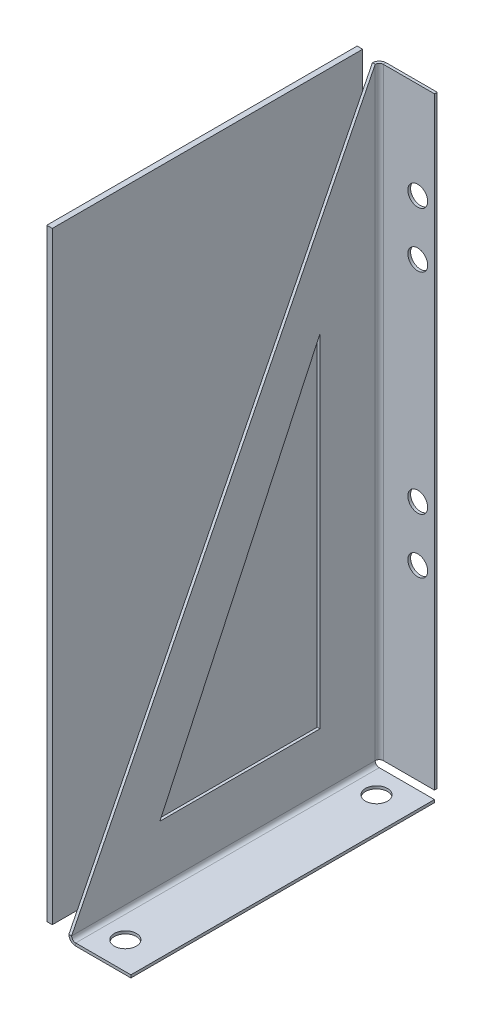
ISO-10303-21;
HEADER;
FILE_DESCRIPTION(('STEP AP214'),'2;1');
FILE_NAME('part.step','',(''),(''),'','','');
FILE_SCHEMA(('AUTOMOTIVE_DESIGN { 1 0 10303 214 1 1 1 1 }'));
ENDSEC;
DATA;
#1=APPLICATION_CONTEXT('core data for automotive mechanical design processes');
#2=APPLICATION_PROTOCOL_DEFINITION('international standard','automotive_design',2000,#1);
#3=PRODUCT_CONTEXT('',#1,'mechanical');
#4=PRODUCT('Part','Part','',(#3));
#5=PRODUCT_RELATED_PRODUCT_CATEGORY('part','',(#4));
#6=PRODUCT_DEFINITION_FORMATION('','',#4);
#7=PRODUCT_DEFINITION_CONTEXT('part definition',#1,'design');
#8=PRODUCT_DEFINITION('design','',#6,#7);
#9=PRODUCT_DEFINITION_SHAPE('','',#8);
#10=(LENGTH_UNIT() NAMED_UNIT(*) SI_UNIT(.MILLI.,.METRE.));
#11=(NAMED_UNIT(*) PLANE_ANGLE_UNIT() SI_UNIT($,.RADIAN.));
#12=(NAMED_UNIT(*) SI_UNIT($,.STERADIAN.) SOLID_ANGLE_UNIT());
#13=UNCERTAINTY_MEASURE_WITH_UNIT(LENGTH_MEASURE(1.E-05),#10,'distance_accuracy_value','');
#14=(GEOMETRIC_REPRESENTATION_CONTEXT(3) GLOBAL_UNCERTAINTY_ASSIGNED_CONTEXT((#13)) GLOBAL_UNIT_ASSIGNED_CONTEXT((#10,
#11,#12)) REPRESENTATION_CONTEXT('',''));
#15=CARTESIAN_POINT('',(0.,0.,0.));
#16=DIRECTION('',(0.,0.,1.));
#17=DIRECTION('',(1.,0.,0.));
#18=AXIS2_PLACEMENT_3D('',#15,#16,#17);
#19=CARTESIAN_POINT('',(-22.0473724951904,110.,-23.1894911407776));
#20=DIRECTION('',(0.,0.,1.));
#21=DIRECTION('',(1.,0.,0.));
#22=AXIS2_PLACEMENT_3D('',#19,#20,#21);
#23=PLANE('',#22);
#24=DIRECTION('',(0.,-1.,0.));
#25=VECTOR('',#24,1.);
#26=CARTESIAN_POINT('',(-21.0473724951904,110.,-23.1894911407776));
#27=LINE('',#26,#25);
#28=CARTESIAN_POINT('',(-21.0473724951904,110.,-23.1894911407776));
#29=VERTEX_POINT('',#28);
#30=CARTESIAN_POINT('',(-21.0473724951901,0.736599999999981,-23.1894911407776));
#31=VERTEX_POINT('',#30);
#32=EDGE_CURVE('E149',#29,#31,#27,.T.);
#33=ORIENTED_EDGE('',*,*,#32,.T.);
#34=DIRECTION('',(1.,0.,0.));
#35=VECTOR('',#34,1.);
#36=CARTESIAN_POINT('',(-22.0473724951901,0.736599999999978,-23.1894911407776));
#37=LINE('',#36,#35);
#38=CARTESIAN_POINT('',(-22.0473724951901,0.736599999999978,-23.1894911407776));
#39=VERTEX_POINT('',#38);
#40=EDGE_CURVE('E14',#39,#31,#37,.T.);
#41=ORIENTED_EDGE('',*,*,#40,.F.);
#42=DIRECTION('',(0.,-1.,0.));
#43=VECTOR('',#42,1.);
#44=CARTESIAN_POINT('',(-22.0473724951904,110.,-23.1894911407776));
#45=LINE('',#44,#43);
#46=CARTESIAN_POINT('',(-22.0473724951904,110.,-23.1894911407776));
#47=VERTEX_POINT('',#46);
#48=EDGE_CURVE('E137',#47,#39,#45,.T.);
#49=ORIENTED_EDGE('',*,*,#48,.F.);
#50=DIRECTION('',(1.,0.,0.));
#51=VECTOR('',#50,1.);
#52=CARTESIAN_POINT('',(-22.0473724951904,110.,-23.1894911407776));
#53=LINE('',#52,#51);
#54=EDGE_CURVE('E145',#47,#29,#53,.T.);
#55=ORIENTED_EDGE('',*,*,#54,.T.);
#56=EDGE_LOOP('',(#33,#41,#49,#55));
#57=FACE_BOUND('',#56,.T.);
#58=ADVANCED_FACE('F86',(#57),#23,.F.);
#59=CARTESIAN_POINT('',(-22.0473724951901,0.736599999999978,-23.1894911407776));
#60=DIRECTION('',(0.,1.,0.));
#61=DIRECTION('',(-1.,0.,0.));
#62=AXIS2_PLACEMENT_3D('',#59,#60,#61);
#63=PLANE('',#62);
#64=DIRECTION('',(0.,0.,1.));
#65=VECTOR('',#64,1.);
#66=CARTESIAN_POINT('',(-21.0473724951901,0.736599999999981,-23.1894911407776));
#67=LINE('',#66,#65);
#68=CARTESIAN_POINT('',(-21.0473724951901,0.736599999999981,33.0471088592224));
#69=VERTEX_POINT('',#68);
#70=EDGE_CURVE('E141',#31,#69,#67,.T.);
#71=ORIENTED_EDGE('',*,*,#70,.T.);
#72=DIRECTION('',(1.,0.,0.));
#73=VECTOR('',#72,1.);
#74=CARTESIAN_POINT('',(-22.0473724951901,0.736599999999978,33.0471088592224));
#75=LINE('',#74,#73);
#76=CARTESIAN_POINT('',(-22.0473724951901,0.736599999999978,33.0471088592224));
#77=VERTEX_POINT('',#76);
#78=EDGE_CURVE('E94',#77,#69,#75,.T.);
#79=ORIENTED_EDGE('',*,*,#78,.F.);
#80=DIRECTION('',(0.,0.,1.));
#81=VECTOR('',#80,1.);
#82=CARTESIAN_POINT('',(-22.0473724951901,0.736599999999978,-23.1894911407776));
#83=LINE('',#82,#81);
#84=EDGE_CURVE('E132',#39,#77,#83,.T.);
#85=ORIENTED_EDGE('',*,*,#84,.F.);
#86=ORIENTED_EDGE('',*,*,#40,.T.);
#87=EDGE_LOOP('',(#71,#79,#85,#86));
#88=FACE_BOUND('',#87,.T.);
#89=ADVANCED_FACE('F140',(#88),#63,.F.);
#90=CARTESIAN_POINT('',(-22.0473724951904,110.,33.0471088592224));
#91=DIRECTION('',(0.,0.,-1.));
#92=DIRECTION('',(0.,1.,0.));
#93=AXIS2_PLACEMENT_3D('',#90,#91,#92);
#94=PLANE('',#93);
#95=DIRECTION('',(0.,1.,0.));
#96=VECTOR('',#95,1.);
#97=CARTESIAN_POINT('',(-21.0473724951904,110.,33.0471088592224));
#98=LINE('',#97,#96);
#99=CARTESIAN_POINT('',(-21.0473724951904,110.,33.0471088592224));
#100=VERTEX_POINT('',#99);
#101=EDGE_CURVE('E119',#69,#100,#98,.T.);
#102=ORIENTED_EDGE('',*,*,#101,.T.);
#103=DIRECTION('',(1.,0.,0.));
#104=VECTOR('',#103,1.);
#105=CARTESIAN_POINT('',(-22.0473724951904,110.,33.0471088592224));
#106=LINE('',#105,#104);
#107=CARTESIAN_POINT('',(-22.0473724951904,110.,33.0471088592224));
#108=VERTEX_POINT('',#107);
#109=EDGE_CURVE('E142',#108,#100,#106,.T.);
#110=ORIENTED_EDGE('',*,*,#109,.F.);
#111=DIRECTION('',(0.,1.,0.));
#112=VECTOR('',#111,1.);
#113=CARTESIAN_POINT('',(-22.0473724951904,110.,33.0471088592224));
#114=LINE('',#113,#112);
#115=EDGE_CURVE('E135',#77,#108,#114,.T.);
#116=ORIENTED_EDGE('',*,*,#115,.F.);
#117=ORIENTED_EDGE('',*,*,#78,.T.);
#118=EDGE_LOOP('',(#102,#110,#116,#117));
#119=FACE_BOUND('',#118,.T.);
#120=ADVANCED_FACE('F143',(#119),#94,.F.);
#121=CARTESIAN_POINT('',(-22.0473724951904,110.,-23.1894911407776));
#122=DIRECTION('',(0.,-1.,0.));
#123=DIRECTION('',(1.,0.,0.));
#124=AXIS2_PLACEMENT_3D('',#121,#122,#123);
#125=PLANE('',#124);
#126=DIRECTION('',(0.,0.,-1.));
#127=VECTOR('',#126,1.);
#128=CARTESIAN_POINT('',(-21.0473724951904,110.,-23.1894911407776));
#129=LINE('',#128,#127);
#130=EDGE_CURVE('E125',#100,#29,#129,.T.);
#131=ORIENTED_EDGE('',*,*,#130,.T.);
#132=ORIENTED_EDGE('',*,*,#54,.F.);
#133=DIRECTION('',(0.,0.,-1.));
#134=VECTOR('',#133,1.);
#135=CARTESIAN_POINT('',(-22.0473724951904,110.,-23.1894911407776));
#136=LINE('',#135,#134);
#137=EDGE_CURVE('E102',#108,#47,#136,.T.);
#138=ORIENTED_EDGE('',*,*,#137,.F.);
#139=ORIENTED_EDGE('',*,*,#109,.T.);
#140=EDGE_LOOP('',(#131,#132,#138,#139));
#141=FACE_BOUND('',#140,.T.);
#142=ADVANCED_FACE('F156',(#141),#125,.F.);
#143=CARTESIAN_POINT('',(-22.0473724951901,0.,0.));
#144=DIRECTION('',(-1.,0.,0.));
#145=DIRECTION('',(0.,-1.,0.));
#146=AXIS2_PLACEMENT_3D('',#143,#144,#145);
#147=PLANE('',#146);
#148=ORIENTED_EDGE('',*,*,#48,.T.);
#149=ORIENTED_EDGE('',*,*,#84,.T.);
#150=ORIENTED_EDGE('',*,*,#115,.T.);
#151=ORIENTED_EDGE('',*,*,#137,.T.);
#152=EDGE_LOOP('',(#148,#149,#150,#151));
#153=FACE_BOUND('',#152,.T.);
#154=ADVANCED_FACE('F133',(#153),#147,.T.);
#155=CARTESIAN_POINT('',(-21.0473724951901,0.,0.));
#156=DIRECTION('',(-1.,0.,0.));
#157=DIRECTION('',(0.,-1.,0.));
#158=AXIS2_PLACEMENT_3D('',#155,#156,#157);
#159=PLANE('',#158);
#160=ORIENTED_EDGE('',*,*,#32,.F.);
#161=ORIENTED_EDGE('',*,*,#130,.F.);
#162=ORIENTED_EDGE('',*,*,#101,.F.);
#163=ORIENTED_EDGE('',*,*,#70,.F.);
#164=EDGE_LOOP('',(#160,#161,#162,#163));
#165=FACE_BOUND('',#164,.T.);
#166=ADVANCED_FACE('F159',(#165),#159,.F.);
#167=CLOSED_SHELL('',(#58,#89,#120,#142,#154,#166));
#168=MANIFOLD_SOLID_BREP('B2_NOT_SHOWN',#167);
#169=CARTESIAN_POINT('',(-18.0473724951901,0.,0.));
#170=DIRECTION('',(1.,0.,0.));
#171=DIRECTION('',(0.,1.,0.));
#172=AXIS2_PLACEMENT_3D('',#169,#170,#171);
#173=PLANE('',#172);
#174=DIRECTION('',(0.,-1.,0.));
#175=VECTOR('',#174,1.);
#176=CARTESIAN_POINT('',(-18.0473724951903,72.7366,-11.9528911407776));
#177=LINE('',#176,#175);
#178=CARTESIAN_POINT('',(-18.0473724951903,72.7366,-11.9528911407776));
#179=VERTEX_POINT('',#178);
#180=CARTESIAN_POINT('',(-18.0473724951901,10.7366,-11.9528911407776));
#181=VERTEX_POINT('',#180);
#182=EDGE_CURVE('E319',#179,#181,#177,.T.);
#183=ORIENTED_EDGE('',*,*,#182,.F.);
#184=DIRECTION('',(0.,0.905809543168539,-0.423685108901414));
#185=VECTOR('',#184,1.);
#186=CARTESIAN_POINT('',(-18.0473724951903,72.7366,-11.9528911407776));
#187=LINE('',#186,#185);
#188=CARTESIAN_POINT('',(-18.0473724951901,10.7366,17.0471088592224));
#189=VERTEX_POINT('',#188);
#190=EDGE_CURVE('E224',#189,#179,#187,.T.);
#191=ORIENTED_EDGE('',*,*,#190,.F.);
#192=DIRECTION('',(0.,0.,1.));
#193=VECTOR('',#192,1.);
#194=CARTESIAN_POINT('',(-18.0473724951901,10.7366,-11.9528911407776));
#195=LINE('',#194,#193);
#196=EDGE_CURVE('E312',#181,#189,#195,.T.);
#197=ORIENTED_EDGE('',*,*,#196,.F.);
#198=EDGE_LOOP('',(#183,#191,#197));
#199=FACE_BOUND('',#198,.T.);
#200=DIRECTION('',(0.,0.893219618479334,-0.449620632493253));
#201=VECTOR('',#200,1.);
#202=CARTESIAN_POINT('',(-18.0473724951901,13.4209584995767,26.66217376223));
#203=LINE('',#202,#201);
#204=CARTESIAN_POINT('',(-18.0473724951901,0.736599999999992,33.0471088592224));
#205=VERTEX_POINT('',#204);
#206=CARTESIAN_POINT('',(-18.0473724951904,110.,-21.9528911407776));
#207=VERTEX_POINT('',#206);
#208=EDGE_CURVE('E330',#205,#207,#203,.T.);
#209=ORIENTED_EDGE('',*,*,#208,.T.);
#210=DIRECTION('',(0.,-1.,0.));
#211=VECTOR('',#210,1.);
#212=CARTESIAN_POINT('',(-18.0473724951901,0.,-21.9528911407776));
#213=LINE('',#212,#211);
#214=CARTESIAN_POINT('',(-18.0473724951901,0.736599999999995,-21.9528911407776));
#215=VERTEX_POINT('',#214);
#216=EDGE_CURVE('E393',#207,#215,#213,.T.);
#217=ORIENTED_EDGE('',*,*,#216,.T.);
#218=DIRECTION('',(0.,0.,1.));
#219=VECTOR('',#218,1.);
#220=CARTESIAN_POINT('',(-18.0473724951901,0.736599999999995,-21.9528911407776));
#221=LINE('',#220,#219);
#222=EDGE_CURVE('E398',#205,#215,#221,.F.);
#223=ORIENTED_EDGE('',*,*,#222,.F.);
#224=EDGE_LOOP('',(#209,#217,#223));
#225=FACE_BOUND('',#224,.T.);
#226=ADVANCED_FACE('F209',(#199,#225),#173,.F.);
#227=CARTESIAN_POINT('',(-17.5473724951901,0.,0.));
#228=DIRECTION('',(1.,0.,0.));
#229=DIRECTION('',(0.,1.,0.));
#230=AXIS2_PLACEMENT_3D('',#227,#228,#229);
#231=PLANE('',#230);
#232=DIRECTION('',(0.,-0.905809543168539,0.423685108901414));
#233=VECTOR('',#232,1.);
#234=CARTESIAN_POINT('',(-17.5473724951901,8.46962269559907,18.1074692112809));
#235=LINE('',#234,#233);
#236=CARTESIAN_POINT('',(-17.5473724951902,72.7366,-11.9528911407776));
#237=VERTEX_POINT('',#236);
#238=CARTESIAN_POINT('',(-17.5473724951901,10.7366,17.0471088592224));
#239=VERTEX_POINT('',#238);
#240=EDGE_CURVE('E84',#237,#239,#235,.T.);
#241=ORIENTED_EDGE('',*,*,#240,.F.);
#242=DIRECTION('',(0.,1.,0.));
#243=VECTOR('',#242,1.);
#244=CARTESIAN_POINT('',(-17.5473724951901,0.,-11.9528911407776));
#245=LINE('',#244,#243);
#246=CARTESIAN_POINT('',(-17.5473724951901,10.7366,-11.9528911407776));
#247=VERTEX_POINT('',#246);
#248=EDGE_CURVE('E447',#247,#237,#245,.T.);
#249=ORIENTED_EDGE('',*,*,#248,.F.);
#250=DIRECTION('',(0.,0.,-1.));
#251=VECTOR('',#250,1.);
#252=CARTESIAN_POINT('',(-17.5473724951901,10.7366,0.));
#253=LINE('',#252,#251);
#254=EDGE_CURVE('E217',#239,#247,#253,.T.);
#255=ORIENTED_EDGE('',*,*,#254,.F.);
#256=EDGE_LOOP('',(#241,#249,#255));
#257=FACE_BOUND('',#256,.T.);
#258=DIRECTION('',(0.,1.,0.));
#259=VECTOR('',#258,1.);
#260=CARTESIAN_POINT('',(-17.5473724951901,0.,-21.9528911407776));
#261=LINE('',#260,#259);
#262=CARTESIAN_POINT('',(-17.5473724951905,110.,-21.9528911407776));
#263=VERTEX_POINT('',#262);
#264=CARTESIAN_POINT('',(-17.54737249519,0.736600000000004,-21.9528911407776));
#265=VERTEX_POINT('',#264);
#266=EDGE_CURVE('E396',#263,#265,#261,.F.);
#267=ORIENTED_EDGE('',*,*,#266,.F.);
#268=DIRECTION('',(0.,0.893219618479334,-0.449620632493253));
#269=VECTOR('',#268,1.);
#270=CARTESIAN_POINT('',(-17.5473724951901,13.4209584995767,26.66217376223));
#271=LINE('',#270,#269);
#272=CARTESIAN_POINT('',(-17.5473724951902,0.736599999999993,33.0471088592224));
#273=VERTEX_POINT('',#272);
#274=EDGE_CURVE('E328',#273,#263,#271,.T.);
#275=ORIENTED_EDGE('',*,*,#274,.F.);
#276=DIRECTION('',(0.,0.,1.));
#277=VECTOR('',#276,1.);
#278=CARTESIAN_POINT('',(-17.5473724951901,0.736599999999997,-21.9528911407776));
#279=LINE('',#278,#277);
#280=EDGE_CURVE('E404',#265,#273,#279,.T.);
#281=ORIENTED_EDGE('',*,*,#280,.F.);
#282=EDGE_LOOP('',(#267,#275,#281));
#283=FACE_BOUND('',#282,.T.);
#284=ADVANCED_FACE('F457',(#257,#283),#231,.T.);
#285=CARTESIAN_POINT('',(-16.8107724951901,-0.5,-21.9528911407776));
#286=DIRECTION('',(0.,0.,-1.));
#287=DIRECTION('',(-1.,0.,0.));
#288=AXIS2_PLACEMENT_3D('',#285,#286,#287);
#289=PLANE('',#288);
#290=DIRECTION('',(-1.,0.,0.));
#291=VECTOR('',#290,1.);
#292=CARTESIAN_POINT('',(-16.8107724951901,0.,-21.9528911407776));
#293=LINE('',#292,#291);
#294=CARTESIAN_POINT('',(-6.81077249519007,0.,-21.9528911407776));
#295=VERTEX_POINT('',#294);
#296=CARTESIAN_POINT('',(-16.8107724951901,0.,-21.9528911407776));
#297=VERTEX_POINT('',#296);
#298=EDGE_CURVE('E425',#295,#297,#293,.T.);
#299=ORIENTED_EDGE('',*,*,#298,.F.);
#300=DIRECTION('',(0.,1.,0.));
#301=VECTOR('',#300,1.);
#302=CARTESIAN_POINT('',(-6.81077249519007,-0.5,-21.9528911407776));
#303=LINE('',#302,#301);
#304=CARTESIAN_POINT('',(-6.81077249519007,-0.5,-21.9528911407776));
#305=VERTEX_POINT('',#304);
#306=EDGE_CURVE('E448',#305,#295,#303,.T.);
#307=ORIENTED_EDGE('',*,*,#306,.F.);
#308=DIRECTION('',(-1.,0.,0.));
#309=VECTOR('',#308,1.);
#310=CARTESIAN_POINT('',(-16.8107724951901,-0.5,-21.9528911407776));
#311=LINE('',#310,#309);
#312=CARTESIAN_POINT('',(-16.8107724951901,-0.5,-21.9528911407776));
#313=VERTEX_POINT('',#312);
#314=EDGE_CURVE('E431',#305,#313,#311,.T.);
#315=ORIENTED_EDGE('',*,*,#314,.T.);
#316=DIRECTION('',(0.,1.,0.));
#317=VECTOR('',#316,1.);
#318=CARTESIAN_POINT('',(-16.8107724951901,-0.5,-21.9528911407776));
#319=LINE('',#318,#317);
#320=EDGE_CURVE('E445',#313,#297,#319,.T.);
#321=ORIENTED_EDGE('',*,*,#320,.T.);
#322=EDGE_LOOP('',(#299,#307,#315,#321));
#323=FACE_BOUND('',#322,.T.);
#324=ADVANCED_FACE('F460',(#323),#289,.T.);
#325=CARTESIAN_POINT('',(-6.81077249519007,-0.5,-21.9528911407776));
#326=DIRECTION('',(1.,0.,0.));
#327=DIRECTION('',(0.,0.,-1.));
#328=AXIS2_PLACEMENT_3D('',#325,#326,#327);
#329=PLANE('',#328);
#330=DIRECTION('',(0.,0.,-1.));
#331=VECTOR('',#330,1.);
#332=CARTESIAN_POINT('',(-6.81077249519007,0.,-21.9528911407776));
#333=LINE('',#332,#331);
#334=CARTESIAN_POINT('',(-6.81077249519006,0.,33.0471088592224));
#335=VERTEX_POINT('',#334);
#336=EDGE_CURVE('E440',#335,#295,#333,.T.);
#337=ORIENTED_EDGE('',*,*,#336,.F.);
#338=DIRECTION('',(0.,1.,0.));
#339=VECTOR('',#338,1.);
#340=CARTESIAN_POINT('',(-6.81077249519006,-0.5,33.0471088592224));
#341=LINE('',#340,#339);
#342=CARTESIAN_POINT('',(-6.81077249519006,-0.5,33.0471088592224));
#343=VERTEX_POINT('',#342);
#344=EDGE_CURVE('E450',#343,#335,#341,.T.);
#345=ORIENTED_EDGE('',*,*,#344,.F.);
#346=DIRECTION('',(0.,0.,-1.));
#347=VECTOR('',#346,1.);
#348=CARTESIAN_POINT('',(-6.81077249519007,-0.5,-21.9528911407776));
#349=LINE('',#348,#347);
#350=EDGE_CURVE('E428',#343,#305,#349,.T.);
#351=ORIENTED_EDGE('',*,*,#350,.T.);
#352=ORIENTED_EDGE('',*,*,#306,.T.);
#353=EDGE_LOOP('',(#337,#345,#351,#352));
#354=FACE_BOUND('',#353,.T.);
#355=ADVANCED_FACE('F499',(#354),#329,.T.);
#356=CARTESIAN_POINT('',(-16.8107724951901,-0.5,33.0471088592224));
#357=DIRECTION('',(0.,0.,1.));
#358=DIRECTION('',(1.,0.,0.));
#359=AXIS2_PLACEMENT_3D('',#356,#357,#358);
#360=PLANE('',#359);
#361=DIRECTION('',(1.,0.,0.));
#362=VECTOR('',#361,1.);
#363=CARTESIAN_POINT('',(-16.8107724951901,0.,33.0471088592224));
#364=LINE('',#363,#362);
#365=CARTESIAN_POINT('',(-16.8107724951901,0.,33.0471088592224));
#366=VERTEX_POINT('',#365);
#367=EDGE_CURVE('E437',#366,#335,#364,.T.);
#368=ORIENTED_EDGE('',*,*,#367,.F.);
#369=DIRECTION('',(0.,1.,0.));
#370=VECTOR('',#369,1.);
#371=CARTESIAN_POINT('',(-16.8107724951901,-0.5,33.0471088592224));
#372=LINE('',#371,#370);
#373=CARTESIAN_POINT('',(-16.8107724951901,-0.500000000000005,33.0471088592224));
#374=VERTEX_POINT('',#373);
#375=EDGE_CURVE('E434',#374,#366,#372,.T.);
#376=ORIENTED_EDGE('',*,*,#375,.F.);
#377=DIRECTION('',(1.,0.,0.));
#378=VECTOR('',#377,1.);
#379=CARTESIAN_POINT('',(-16.8107724951901,-0.5,33.0471088592224));
#380=LINE('',#379,#378);
#381=EDGE_CURVE('E424',#374,#343,#380,.T.);
#382=ORIENTED_EDGE('',*,*,#381,.T.);
#383=ORIENTED_EDGE('',*,*,#344,.T.);
#384=EDGE_LOOP('',(#368,#376,#382,#383));
#385=FACE_BOUND('',#384,.T.);
#386=ADVANCED_FACE('F211',(#385),#360,.T.);
#387=CARTESIAN_POINT('',(0.,-0.5,0.));
#388=DIRECTION('',(0.,1.,0.));
#389=DIRECTION('',(0.,0.,1.));
#390=AXIS2_PLACEMENT_3D('',#387,#388,#389);
#391=PLANE('',#390);
#392=CARTESIAN_POINT('',(-12.8107724951901,-0.5,28.0471088592224));
#393=DIRECTION('',(0.,1.,0.));
#394=DIRECTION('',(0.,0.,1.));
#395=AXIS2_PLACEMENT_3D('',#392,#393,#394);
#396=CIRCLE('',#395,2.);
#397=CARTESIAN_POINT('',(-12.8107724951901,-0.5,30.0471088592224));
#398=VERTEX_POINT('',#397);
#399=EDGE_CURVE('E337',#398,#398,#396,.T.);
#400=ORIENTED_EDGE('',*,*,#399,.T.);
#401=EDGE_LOOP('',(#400));
#402=FACE_BOUND('',#401,.T.);
#403=CARTESIAN_POINT('',(-12.8107724951901,-0.5,-17.4528911407776));
#404=DIRECTION('',(0.,1.,0.));
#405=DIRECTION('',(0.,0.,1.));
#406=AXIS2_PLACEMENT_3D('',#403,#404,#405);
#407=CIRCLE('',#406,2.);
#408=CARTESIAN_POINT('',(-12.8107724951901,-0.5,-15.4528911407776));
#409=VERTEX_POINT('',#408);
#410=EDGE_CURVE('E343',#409,#409,#407,.T.);
#411=ORIENTED_EDGE('',*,*,#410,.T.);
#412=EDGE_LOOP('',(#411));
#413=FACE_BOUND('',#412,.T.);
#414=DIRECTION('',(0.,0.,1.));
#415=VECTOR('',#414,1.);
#416=CARTESIAN_POINT('',(-16.8107724951901,-0.5,-21.9528911407776));
#417=LINE('',#416,#415);
#418=EDGE_CURVE('E421',#313,#374,#417,.T.);
#419=ORIENTED_EDGE('',*,*,#418,.F.);
#420=ORIENTED_EDGE('',*,*,#314,.F.);
#421=ORIENTED_EDGE('',*,*,#350,.F.);
#422=ORIENTED_EDGE('',*,*,#381,.F.);
#423=EDGE_LOOP('',(#419,#420,#421,#422));
#424=FACE_BOUND('',#423,.T.);
#425=ADVANCED_FACE('F494',(#402,#413,#424),#391,.F.);
#426=CARTESIAN_POINT('',(0.,0.,0.));
#427=DIRECTION('',(0.,1.,0.));
#428=DIRECTION('',(0.,0.,1.));
#429=AXIS2_PLACEMENT_3D('',#426,#427,#428);
#430=PLANE('',#429);
#431=CARTESIAN_POINT('',(-12.8107724951901,0.,28.0471088592224));
#432=DIRECTION('',(0.,1.,0.));
#433=DIRECTION('',(0.,0.,1.));
#434=AXIS2_PLACEMENT_3D('',#431,#432,#433);
#435=CIRCLE('',#434,2.);
#436=CARTESIAN_POINT('',(-12.8107724951901,0.,30.0471088592224));
#437=VERTEX_POINT('',#436);
#438=EDGE_CURVE('E333',#437,#437,#435,.T.);
#439=ORIENTED_EDGE('',*,*,#438,.F.);
#440=EDGE_LOOP('',(#439));
#441=FACE_BOUND('',#440,.T.);
#442=CARTESIAN_POINT('',(-12.8107724951901,0.,-17.4528911407776));
#443=DIRECTION('',(0.,1.,0.));
#444=DIRECTION('',(0.,0.,1.));
#445=AXIS2_PLACEMENT_3D('',#442,#443,#444);
#446=CIRCLE('',#445,2.);
#447=CARTESIAN_POINT('',(-12.8107724951901,0.,-15.4528911407776));
#448=VERTEX_POINT('',#447);
#449=EDGE_CURVE('E340',#448,#448,#446,.T.);
#450=ORIENTED_EDGE('',*,*,#449,.F.);
#451=EDGE_LOOP('',(#450));
#452=FACE_BOUND('',#451,.T.);
#453=DIRECTION('',(0.,0.,1.));
#454=VECTOR('',#453,1.);
#455=CARTESIAN_POINT('',(-16.8107724951901,0.,-21.9528911407776));
#456=LINE('',#455,#454);
#457=EDGE_CURVE('E412',#297,#366,#456,.T.);
#458=ORIENTED_EDGE('',*,*,#457,.T.);
#459=ORIENTED_EDGE('',*,*,#367,.T.);
#460=ORIENTED_EDGE('',*,*,#336,.T.);
#461=ORIENTED_EDGE('',*,*,#298,.T.);
#462=EDGE_LOOP('',(#458,#459,#460,#461));
#463=FACE_BOUND('',#462,.T.);
#464=ADVANCED_FACE('F483',(#441,#452,#463),#430,.T.);
#465=CARTESIAN_POINT('',(-16.8107724951901,0.7366,-21.9528911407776));
#466=DIRECTION('',(0.,0.,-1.));
#467=DIRECTION('',(0.,1.,0.));
#468=AXIS2_PLACEMENT_3D('',#465,#466,#467);
#469=PLANE('',#468);
#470=DIRECTION('',(1.,0.,0.));
#471=VECTOR('',#470,1.);
#472=CARTESIAN_POINT('',(-18.0473724951901,0.736599999999995,-21.9528911407776));
#473=LINE('',#472,#471);
#474=EDGE_CURVE('E380',#265,#215,#473,.F.);
#475=ORIENTED_EDGE('',*,*,#474,.F.);
#476=CARTESIAN_POINT('',(-16.8107724951901,0.7366,-21.9528911407776));
#477=DIRECTION('',(0.,0.,1.));
#478=DIRECTION('',(0.,-1.,0.));
#479=AXIS2_PLACEMENT_3D('',#476,#477,#478);
#480=CIRCLE('',#479,0.7366);
#481=EDGE_CURVE('E416',#297,#265,#480,.F.);
#482=ORIENTED_EDGE('',*,*,#481,.F.);
#483=ORIENTED_EDGE('',*,*,#320,.F.);
#484=CARTESIAN_POINT('',(-16.8107724951901,0.7366,-21.9528911407776));
#485=DIRECTION('',(0.,0.,1.));
#486=DIRECTION('',(0.,-1.,0.));
#487=AXIS2_PLACEMENT_3D('',#484,#485,#486);
#488=CIRCLE('',#487,1.2366);
#489=EDGE_CURVE('E409',#313,#215,#488,.F.);
#490=ORIENTED_EDGE('',*,*,#489,.T.);
#491=EDGE_LOOP('',(#475,#482,#483,#490));
#492=FACE_BOUND('',#491,.T.);
#493=ADVANCED_FACE('F475',(#492),#469,.T.);
#494=CARTESIAN_POINT('',(-16.8107724951901,0.736599999999996,33.0471088592224));
#495=DIRECTION('',(0.,0.,-1.));
#496=DIRECTION('',(0.,1.,0.));
#497=AXIS2_PLACEMENT_3D('',#494,#495,#496);
#498=PLANE('',#497);
#499=CARTESIAN_POINT('',(-16.8107724951901,0.736599999999996,33.0471088592224));
#500=DIRECTION('',(0.,0.,1.));
#501=DIRECTION('',(0.,-1.,0.));
#502=AXIS2_PLACEMENT_3D('',#499,#500,#501);
#503=CIRCLE('',#502,0.7366);
#504=EDGE_CURVE('E392',#273,#366,#503,.T.);
#505=ORIENTED_EDGE('',*,*,#504,.F.);
#506=DIRECTION('',(1.,0.,0.));
#507=VECTOR('',#506,1.);
#508=CARTESIAN_POINT('',(-17.5473724951901,0.736599999999993,33.0471088592224));
#509=LINE('',#508,#507);
#510=EDGE_CURVE('E401',#273,#205,#509,.F.);
#511=ORIENTED_EDGE('',*,*,#510,.T.);
#512=CARTESIAN_POINT('',(-16.8107724951901,0.736599999999996,33.0471088592224));
#513=DIRECTION('',(0.,0.,1.));
#514=DIRECTION('',(0.,-1.,0.));
#515=AXIS2_PLACEMENT_3D('',#512,#513,#514);
#516=CIRCLE('',#515,1.2366);
#517=EDGE_CURVE('E413',#205,#374,#516,.T.);
#518=ORIENTED_EDGE('',*,*,#517,.T.);
#519=ORIENTED_EDGE('',*,*,#375,.T.);
#520=EDGE_LOOP('',(#505,#511,#518,#519));
#521=FACE_BOUND('',#520,.T.);
#522=ADVANCED_FACE('F487',(#521),#498,.F.);
#523=CARTESIAN_POINT('',(-16.8107724951901,0.736599999999996,33.0471088592224));
#524=DIRECTION('',(0.,0.,1.));
#525=DIRECTION('',(-1.,0.,0.));
#526=AXIS2_PLACEMENT_3D('',#523,#524,#525);
#527=CYLINDRICAL_SURFACE('',#526,1.2366);
#528=ORIENTED_EDGE('',*,*,#418,.T.);
#529=ORIENTED_EDGE('',*,*,#517,.F.);
#530=ORIENTED_EDGE('',*,*,#222,.T.);
#531=ORIENTED_EDGE('',*,*,#489,.F.);
#532=EDGE_LOOP('',(#528,#529,#530,#531));
#533=FACE_BOUND('',#532,.T.);
#534=ADVANCED_FACE('F491',(#533),#527,.T.);
#535=CARTESIAN_POINT('',(-16.8107724951901,0.736599999999996,33.0471088592224));
#536=DIRECTION('',(0.,0.,1.));
#537=DIRECTION('',(-1.,0.,0.));
#538=AXIS2_PLACEMENT_3D('',#535,#536,#537);
#539=CYLINDRICAL_SURFACE('',#538,0.7366);
#540=ORIENTED_EDGE('',*,*,#457,.F.);
#541=ORIENTED_EDGE('',*,*,#481,.T.);
#542=ORIENTED_EDGE('',*,*,#280,.T.);
#543=ORIENTED_EDGE('',*,*,#504,.T.);
#544=EDGE_LOOP('',(#540,#541,#542,#543));
#545=FACE_BOUND('',#544,.T.);
#546=ADVANCED_FACE('F480',(#545),#539,.F.);
#547=CARTESIAN_POINT('',(-16.81077249519,0.736600000000004,-21.9528911407776));
#548=DIRECTION('',(0.,-1.,0.));
#549=DIRECTION('',(1.,0.,0.));
#550=AXIS2_PLACEMENT_3D('',#547,#548,#549);
#551=PLANE('',#550);
#552=DIRECTION('',(0.,0.,1.));
#553=VECTOR('',#552,1.);
#554=CARTESIAN_POINT('',(-16.8107724951901,0.7366,-23.1894911407776));
#555=LINE('',#554,#553);
#556=CARTESIAN_POINT('',(-16.81077249519,0.736600000000004,-22.6894911407776));
#557=VERTEX_POINT('',#556);
#558=CARTESIAN_POINT('',(-16.81077249519,0.736600000000004,-23.1894911407776));
#559=VERTEX_POINT('',#558);
#560=EDGE_CURVE('E346',#557,#559,#555,.F.);
#561=ORIENTED_EDGE('',*,*,#560,.F.);
#562=CARTESIAN_POINT('',(-16.81077249519,0.736600000000004,-21.9528911407776));
#563=DIRECTION('',(0.,1.,0.));
#564=DIRECTION('',(-1.,0.,0.));
#565=AXIS2_PLACEMENT_3D('',#562,#563,#564);
#566=CIRCLE('',#565,0.7366);
#567=EDGE_CURVE('E384',#265,#557,#566,.F.);
#568=ORIENTED_EDGE('',*,*,#567,.F.);
#569=ORIENTED_EDGE('',*,*,#474,.T.);
#570=CARTESIAN_POINT('',(-16.81077249519,0.736600000000004,-21.9528911407776));
#571=DIRECTION('',(0.,1.,0.));
#572=DIRECTION('',(-1.,0.,0.));
#573=AXIS2_PLACEMENT_3D('',#570,#571,#572);
#574=CIRCLE('',#573,1.2366);
#575=EDGE_CURVE('E377',#215,#559,#574,.F.);
#576=ORIENTED_EDGE('',*,*,#575,.T.);
#577=EDGE_LOOP('',(#561,#568,#569,#576));
#578=FACE_BOUND('',#577,.T.);
#579=ADVANCED_FACE('F472',(#578),#551,.T.);
#580=CARTESIAN_POINT('',(-16.8107724951905,110.,-21.9528911407776));
#581=DIRECTION('',(0.,-1.,0.));
#582=DIRECTION('',(1.,0.,0.));
#583=AXIS2_PLACEMENT_3D('',#580,#581,#582);
#584=PLANE('',#583);
#585=CARTESIAN_POINT('',(-16.8107724951905,110.,-21.9528911407776));
#586=DIRECTION('',(0.,1.,0.));
#587=DIRECTION('',(-1.,0.,0.));
#588=AXIS2_PLACEMENT_3D('',#585,#586,#587);
#589=CIRCLE('',#588,0.7366);
#590=CARTESIAN_POINT('',(-16.8107724951905,110.,-22.6894911407776));
#591=VERTEX_POINT('',#590);
#592=EDGE_CURVE('E350',#591,#263,#589,.T.);
#593=ORIENTED_EDGE('',*,*,#592,.F.);
#594=DIRECTION('',(0.,0.,1.));
#595=VECTOR('',#594,1.);
#596=CARTESIAN_POINT('',(-16.8107724951904,110.,-22.6894911407776));
#597=LINE('',#596,#595);
#598=CARTESIAN_POINT('',(-16.8107724951904,110.,-23.1894911407776));
#599=VERTEX_POINT('',#598);
#600=EDGE_CURVE('E370',#591,#599,#597,.F.);
#601=ORIENTED_EDGE('',*,*,#600,.T.);
#602=CARTESIAN_POINT('',(-16.8107724951905,110.,-21.9528911407776));
#603=DIRECTION('',(0.,1.,0.));
#604=DIRECTION('',(-1.,0.,0.));
#605=AXIS2_PLACEMENT_3D('',#602,#603,#604);
#606=CIRCLE('',#605,1.2366);
#607=EDGE_CURVE('E381',#599,#207,#606,.T.);
#608=ORIENTED_EDGE('',*,*,#607,.T.);
#609=DIRECTION('',(1.,0.,0.));
#610=VECTOR('',#609,1.);
#611=CARTESIAN_POINT('',(-18.0473724951904,110.,-21.9528911407776));
#612=LINE('',#611,#610);
#613=EDGE_CURVE('E389',#207,#263,#612,.T.);
#614=ORIENTED_EDGE('',*,*,#613,.T.);
#615=EDGE_LOOP('',(#593,#601,#608,#614));
#616=FACE_BOUND('',#615,.T.);
#617=ADVANCED_FACE('F511',(#616),#584,.F.);
#618=CARTESIAN_POINT('',(-16.8107724951905,110.,-21.9528911407776));
#619=DIRECTION('',(0.,1.,0.));
#620=DIRECTION('',(0.,0.,-1.));
#621=AXIS2_PLACEMENT_3D('',#618,#619,#620);
#622=CYLINDRICAL_SURFACE('',#621,1.2366);
#623=ORIENTED_EDGE('',*,*,#216,.F.);
#624=ORIENTED_EDGE('',*,*,#607,.F.);
#625=DIRECTION('',(0.,1.,0.));
#626=VECTOR('',#625,1.);
#627=CARTESIAN_POINT('',(-16.8107724951901,0.736600000000014,-23.1894911407776));
#628=LINE('',#627,#626);
#629=EDGE_CURVE('E368',#599,#559,#628,.F.);
#630=ORIENTED_EDGE('',*,*,#629,.T.);
#631=ORIENTED_EDGE('',*,*,#575,.F.);
#632=EDGE_LOOP('',(#623,#624,#630,#631));
#633=FACE_BOUND('',#632,.T.);
#634=ADVANCED_FACE('F568',(#633),#622,.T.);
#635=CARTESIAN_POINT('',(-16.8107724951905,110.,-21.9528911407776));
#636=DIRECTION('',(0.,1.,0.));
#637=DIRECTION('',(0.,0.,-1.));
#638=AXIS2_PLACEMENT_3D('',#635,#636,#637);
#639=CYLINDRICAL_SURFACE('',#638,0.7366);
#640=ORIENTED_EDGE('',*,*,#266,.T.);
#641=ORIENTED_EDGE('',*,*,#567,.T.);
#642=DIRECTION('',(0.,1.,0.));
#643=VECTOR('',#642,1.);
#644=CARTESIAN_POINT('',(-16.8107724951901,0.736600000000014,-22.6894911407776));
#645=LINE('',#644,#643);
#646=EDGE_CURVE('E373',#557,#591,#645,.T.);
#647=ORIENTED_EDGE('',*,*,#646,.T.);
#648=ORIENTED_EDGE('',*,*,#592,.T.);
#649=EDGE_LOOP('',(#640,#641,#647,#648));
#650=FACE_BOUND('',#649,.T.);
#651=ADVANCED_FACE('F467',(#650),#639,.F.);
#652=CARTESIAN_POINT('',(-7.54737249519044,110.,-23.1894911407777));
#653=DIRECTION('',(0.,-1.,0.));
#654=DIRECTION('',(1.,0.,0.));
#655=AXIS2_PLACEMENT_3D('',#652,#653,#654);
#656=PLANE('',#655);
#657=ORIENTED_EDGE('',*,*,#600,.F.);
#658=DIRECTION('',(-1.,0.,0.));
#659=VECTOR('',#658,1.);
#660=CARTESIAN_POINT('',(-7.54737249519044,110.,-22.6894911407777));
#661=LINE('',#660,#659);
#662=CARTESIAN_POINT('',(-7.54737249519044,110.,-22.6894911407777));
#663=VERTEX_POINT('',#662);
#664=EDGE_CURVE('E366',#591,#663,#661,.F.);
#665=ORIENTED_EDGE('',*,*,#664,.T.);
#666=DIRECTION('',(0.,0.,1.));
#667=VECTOR('',#666,1.);
#668=CARTESIAN_POINT('',(-7.54737249519044,110.,-23.1894911407777));
#669=LINE('',#668,#667);
#670=CARTESIAN_POINT('',(-7.54737249519044,110.,-23.1894911407777));
#671=VERTEX_POINT('',#670);
#672=EDGE_CURVE('E347',#671,#663,#669,.T.);
#673=ORIENTED_EDGE('',*,*,#672,.F.);
#674=DIRECTION('',(1.,0.,0.));
#675=VECTOR('',#674,1.);
#676=CARTESIAN_POINT('',(-5.35877130593373E-13,110.,-23.1894911407777));
#677=LINE('',#676,#675);
#678=EDGE_CURVE('E359',#599,#671,#677,.T.);
#679=ORIENTED_EDGE('',*,*,#678,.F.);
#680=EDGE_LOOP('',(#657,#665,#673,#679));
#681=FACE_BOUND('',#680,.T.);
#682=ADVANCED_FACE('F562',(#681),#656,.F.);
#683=CARTESIAN_POINT('',(-17.5473724951901,0.736599999999997,-23.1894911407776));
#684=DIRECTION('',(0.,1.,0.));
#685=DIRECTION('',(-1.,0.,0.));
#686=AXIS2_PLACEMENT_3D('',#683,#684,#685);
#687=PLANE('',#686);
#688=ORIENTED_EDGE('',*,*,#560,.T.);
#689=DIRECTION('',(-1.,0.,0.));
#690=VECTOR('',#689,1.);
#691=CARTESIAN_POINT('',(0.,0.736600000000058,-23.1894911407777));
#692=LINE('',#691,#690);
#693=CARTESIAN_POINT('',(-7.54737249519006,0.736600000000032,-23.1894911407777));
#694=VERTEX_POINT('',#693);
#695=EDGE_CURVE('E354',#694,#559,#692,.T.);
#696=ORIENTED_EDGE('',*,*,#695,.F.);
#697=DIRECTION('',(0.,0.,1.));
#698=VECTOR('',#697,1.);
#699=CARTESIAN_POINT('',(-7.54737249519006,0.736600000000032,-23.1894911407777));
#700=LINE('',#699,#698);
#701=CARTESIAN_POINT('',(-7.54737249519006,0.736600000000032,-22.6894911407777));
#702=VERTEX_POINT('',#701);
#703=EDGE_CURVE('E351',#694,#702,#700,.T.);
#704=ORIENTED_EDGE('',*,*,#703,.T.);
#705=DIRECTION('',(1.,0.,0.));
#706=VECTOR('',#705,1.);
#707=CARTESIAN_POINT('',(-17.5473724951901,0.736599999999997,-22.6894911407776));
#708=LINE('',#707,#706);
#709=EDGE_CURVE('E361',#702,#557,#708,.F.);
#710=ORIENTED_EDGE('',*,*,#709,.T.);
#711=EDGE_LOOP('',(#688,#696,#704,#710));
#712=FACE_BOUND('',#711,.T.);
#713=ADVANCED_FACE('F556',(#712),#687,.F.);
#714=CARTESIAN_POINT('',(0.,0.,-23.1894911407777));
#715=DIRECTION('',(0.,0.,1.));
#716=DIRECTION('',(1.,0.,0.));
#717=AXIS2_PLACEMENT_3D('',#714,#715,#716);
#718=PLANE('',#717);
#719=CARTESIAN_POINT('',(-10.57077249519,92.4966,-23.1894911407777));
#720=DIRECTION('',(0.,0.,1.));
#721=DIRECTION('',(1.,0.,0.));
#722=AXIS2_PLACEMENT_3D('',#719,#720,#721);
#723=CIRCLE('',#722,1.8);
#724=CARTESIAN_POINT('',(-8.77077249518996,92.4966,-23.1894911407777));
#725=VERTEX_POINT('',#724);
#726=EDGE_CURVE('E628',#725,#725,#723,.T.);
#727=ORIENTED_EDGE('',*,*,#726,.T.);
#728=EDGE_LOOP('',(#727));
#729=FACE_BOUND('',#728,.T.);
#730=CARTESIAN_POINT('',(-10.57077249519,82.4966,-23.1894911407777));
#731=DIRECTION('',(0.,0.,1.));
#732=DIRECTION('',(1.,0.,0.));
#733=AXIS2_PLACEMENT_3D('',#730,#731,#732);
#734=CIRCLE('',#733,1.8);
#735=CARTESIAN_POINT('',(-8.77077249518996,82.4966,-23.1894911407777));
#736=VERTEX_POINT('',#735);
#737=EDGE_CURVE('E632',#736,#736,#734,.T.);
#738=ORIENTED_EDGE('',*,*,#737,.T.);
#739=EDGE_LOOP('',(#738));
#740=FACE_BOUND('',#739,.T.);
#741=CARTESIAN_POINT('',(-10.57077249519,44.4966,-23.1894911407777));
#742=DIRECTION('',(0.,0.,1.));
#743=DIRECTION('',(1.,0.,0.));
#744=AXIS2_PLACEMENT_3D('',#741,#742,#743);
#745=CIRCLE('',#744,1.8);
#746=CARTESIAN_POINT('',(-8.77077249518996,44.4966,-23.1894911407777));
#747=VERTEX_POINT('',#746);
#748=EDGE_CURVE('E641',#747,#747,#745,.T.);
#749=ORIENTED_EDGE('',*,*,#748,.T.);
#750=EDGE_LOOP('',(#749));
#751=FACE_BOUND('',#750,.T.);
#752=CARTESIAN_POINT('',(-10.57077249519,34.4966,-23.1894911407777));
#753=DIRECTION('',(0.,0.,1.));
#754=DIRECTION('',(1.,0.,0.));
#755=AXIS2_PLACEMENT_3D('',#752,#753,#754);
#756=CIRCLE('',#755,1.8);
#757=CARTESIAN_POINT('',(-8.77077249518996,34.4966,-23.1894911407777));
#758=VERTEX_POINT('',#757);
#759=EDGE_CURVE('E647',#758,#758,#756,.T.);
#760=ORIENTED_EDGE('',*,*,#759,.T.);
#761=EDGE_LOOP('',(#760));
#762=FACE_BOUND('',#761,.T.);
#763=ORIENTED_EDGE('',*,*,#629,.F.);
#764=ORIENTED_EDGE('',*,*,#678,.T.);
#765=DIRECTION('',(0.,-1.,0.));
#766=VECTOR('',#765,1.);
#767=CARTESIAN_POINT('',(-7.54737249519005,0.,-23.1894911407777));
#768=LINE('',#767,#766);
#769=EDGE_CURVE('E357',#671,#694,#768,.T.);
#770=ORIENTED_EDGE('',*,*,#769,.T.);
#771=ORIENTED_EDGE('',*,*,#695,.T.);
#772=EDGE_LOOP('',(#763,#764,#770,#771));
#773=FACE_BOUND('',#772,.T.);
#774=ADVANCED_FACE('F553',(#729,#740,#751,#762,#773),#718,.F.);
#775=CARTESIAN_POINT('',(0.,0.,-22.6894911407777));
#776=DIRECTION('',(0.,0.,1.));
#777=DIRECTION('',(1.,0.,0.));
#778=AXIS2_PLACEMENT_3D('',#775,#776,#777);
#779=PLANE('',#778);
#780=CARTESIAN_POINT('',(-10.57077249519,92.4966,-22.6894911407777));
#781=DIRECTION('',(0.,0.,1.));
#782=DIRECTION('',(1.,0.,0.));
#783=AXIS2_PLACEMENT_3D('',#780,#781,#782);
#784=CIRCLE('',#783,1.8);
#785=CARTESIAN_POINT('',(-8.77077249518996,92.4966,-22.6894911407777));
#786=VERTEX_POINT('',#785);
#787=EDGE_CURVE('E625',#786,#786,#784,.T.);
#788=ORIENTED_EDGE('',*,*,#787,.F.);
#789=EDGE_LOOP('',(#788));
#790=FACE_BOUND('',#789,.T.);
#791=CARTESIAN_POINT('',(-10.57077249519,82.4966,-22.6894911407777));
#792=DIRECTION('',(0.,0.,1.));
#793=DIRECTION('',(1.,0.,0.));
#794=AXIS2_PLACEMENT_3D('',#791,#792,#793);
#795=CIRCLE('',#794,1.8);
#796=CARTESIAN_POINT('',(-8.77077249518996,82.4966,-22.6894911407777));
#797=VERTEX_POINT('',#796);
#798=EDGE_CURVE('E629',#797,#797,#795,.T.);
#799=ORIENTED_EDGE('',*,*,#798,.F.);
#800=EDGE_LOOP('',(#799));
#801=FACE_BOUND('',#800,.T.);
#802=CARTESIAN_POINT('',(-10.57077249519,44.4966,-22.6894911407777));
#803=DIRECTION('',(0.,0.,1.));
#804=DIRECTION('',(1.,0.,0.));
#805=AXIS2_PLACEMENT_3D('',#802,#803,#804);
#806=CIRCLE('',#805,1.8);
#807=CARTESIAN_POINT('',(-8.77077249518996,44.4966,-22.6894911407777));
#808=VERTEX_POINT('',#807);
#809=EDGE_CURVE('E638',#808,#808,#806,.T.);
#810=ORIENTED_EDGE('',*,*,#809,.F.);
#811=EDGE_LOOP('',(#810));
#812=FACE_BOUND('',#811,.T.);
#813=CARTESIAN_POINT('',(-10.57077249519,34.4966,-22.6894911407777));
#814=DIRECTION('',(0.,0.,1.));
#815=DIRECTION('',(1.,0.,0.));
#816=AXIS2_PLACEMENT_3D('',#813,#814,#815);
#817=CIRCLE('',#816,1.8);
#818=CARTESIAN_POINT('',(-8.77077249518996,34.4966,-22.6894911407777));
#819=VERTEX_POINT('',#818);
#820=EDGE_CURVE('E644',#819,#819,#817,.T.);
#821=ORIENTED_EDGE('',*,*,#820,.F.);
#822=EDGE_LOOP('',(#821));
#823=FACE_BOUND('',#822,.T.);
#824=ORIENTED_EDGE('',*,*,#664,.F.);
#825=ORIENTED_EDGE('',*,*,#646,.F.);
#826=ORIENTED_EDGE('',*,*,#709,.F.);
#827=DIRECTION('',(0.,1.,0.));
#828=VECTOR('',#827,1.);
#829=CARTESIAN_POINT('',(-7.54737249519006,0.736600000000032,-22.6894911407777));
#830=LINE('',#829,#828);
#831=EDGE_CURVE('E364',#663,#702,#830,.F.);
#832=ORIENTED_EDGE('',*,*,#831,.F.);
#833=EDGE_LOOP('',(#824,#825,#826,#832));
#834=FACE_BOUND('',#833,.T.);
#835=ADVANCED_FACE('F548',(#790,#801,#812,#823,#834),#779,.T.);
#836=CARTESIAN_POINT('',(-7.54737249519006,0.736600000000032,-23.1894911407777));
#837=DIRECTION('',(-1.,0.,0.));
#838=DIRECTION('',(0.,-1.,0.));
#839=AXIS2_PLACEMENT_3D('',#836,#837,#838);
#840=PLANE('',#839);
#841=ORIENTED_EDGE('',*,*,#831,.T.);
#842=ORIENTED_EDGE('',*,*,#703,.F.);
#843=ORIENTED_EDGE('',*,*,#769,.F.);
#844=ORIENTED_EDGE('',*,*,#672,.T.);
#845=EDGE_LOOP('',(#841,#842,#843,#844));
#846=FACE_BOUND('',#845,.T.);
#847=ADVANCED_FACE('F537',(#846),#840,.F.);
#848=CARTESIAN_POINT('',(-12.8107724951901,-1.,-17.4528911407776));
#849=DIRECTION('',(0.,1.,0.));
#850=DIRECTION('',(0.,0.,1.));
#851=AXIS2_PLACEMENT_3D('',#848,#849,#850);
#852=CYLINDRICAL_SURFACE('',#851,2.);
#853=ORIENTED_EDGE('',*,*,#449,.T.);
#854=EDGE_LOOP('',(#853));
#855=FACE_BOUND('',#854,.T.);
#856=ORIENTED_EDGE('',*,*,#410,.F.);
#857=EDGE_LOOP('',(#856));
#858=FACE_BOUND('',#857,.T.);
#859=ADVANCED_FACE('F533',(#855,#858),#852,.F.);
#860=CARTESIAN_POINT('',(-12.8107724951901,-1.,28.0471088592224));
#861=DIRECTION('',(0.,1.,0.));
#862=DIRECTION('',(0.,0.,1.));
#863=AXIS2_PLACEMENT_3D('',#860,#861,#862);
#864=CYLINDRICAL_SURFACE('',#863,2.);
#865=ORIENTED_EDGE('',*,*,#438,.T.);
#866=EDGE_LOOP('',(#865));
#867=FACE_BOUND('',#866,.T.);
#868=ORIENTED_EDGE('',*,*,#399,.F.);
#869=EDGE_LOOP('',(#868));
#870=FACE_BOUND('',#869,.T.);
#871=ADVANCED_FACE('F536',(#867,#870),#864,.F.);
#872=CARTESIAN_POINT('',(-17.5473724951901,13.4209584995767,26.66217376223));
#873=DIRECTION('',(0.,-0.449620632493253,-0.893219618479334));
#874=DIRECTION('',(0.,0.893219618479334,-0.449620632493253));
#875=AXIS2_PLACEMENT_3D('',#872,#873,#874);
#876=PLANE('',#875);
#877=ORIENTED_EDGE('',*,*,#274,.T.);
#878=ORIENTED_EDGE('',*,*,#613,.F.);
#879=ORIENTED_EDGE('',*,*,#208,.F.);
#880=ORIENTED_EDGE('',*,*,#510,.F.);
#881=EDGE_LOOP('',(#877,#878,#879,#880));
#882=FACE_BOUND('',#881,.T.);
#883=ADVANCED_FACE('F545',(#882),#876,.F.);
#884=CARTESIAN_POINT('',(-8.04737249519031,72.7366,-11.9528911407776));
#885=DIRECTION('',(0.,0.423685108901414,0.905809543168539));
#886=DIRECTION('',(0.,-0.905809543168539,0.423685108901414));
#887=AXIS2_PLACEMENT_3D('',#884,#885,#886);
#888=PLANE('',#887);
#889=ORIENTED_EDGE('',*,*,#240,.T.);
#890=DIRECTION('',(-1.,0.,0.));
#891=VECTOR('',#890,1.);
#892=CARTESIAN_POINT('',(-8.04737249519009,10.7366,17.0471088592224));
#893=LINE('',#892,#891);
#894=EDGE_CURVE('E315',#239,#189,#893,.T.);
#895=ORIENTED_EDGE('',*,*,#894,.T.);
#896=ORIENTED_EDGE('',*,*,#190,.T.);
#897=DIRECTION('',(-1.,0.,0.));
#898=VECTOR('',#897,1.);
#899=CARTESIAN_POINT('',(-8.04737249519031,72.7366,-11.9528911407776));
#900=LINE('',#899,#898);
#901=EDGE_CURVE('E316',#237,#179,#900,.T.);
#902=ORIENTED_EDGE('',*,*,#901,.F.);
#903=EDGE_LOOP('',(#889,#895,#896,#902));
#904=FACE_BOUND('',#903,.T.);
#905=ADVANCED_FACE('F456',(#904),#888,.F.);
#906=CARTESIAN_POINT('',(-8.04737249519009,10.7366,-11.9528911407776));
#907=DIRECTION('',(0.,-1.,0.));
#908=DIRECTION('',(1.,0.,0.));
#909=AXIS2_PLACEMENT_3D('',#906,#907,#908);
#910=PLANE('',#909);
#911=ORIENTED_EDGE('',*,*,#254,.T.);
#912=DIRECTION('',(-1.,0.,0.));
#913=VECTOR('',#912,1.);
#914=CARTESIAN_POINT('',(-8.04737249519009,10.7366,-11.9528911407776));
#915=LINE('',#914,#913);
#916=EDGE_CURVE('E232',#247,#181,#915,.T.);
#917=ORIENTED_EDGE('',*,*,#916,.T.);
#918=ORIENTED_EDGE('',*,*,#196,.T.);
#919=ORIENTED_EDGE('',*,*,#894,.F.);
#920=EDGE_LOOP('',(#911,#917,#918,#919));
#921=FACE_BOUND('',#920,.T.);
#922=ADVANCED_FACE('F309',(#921),#910,.F.);
#923=CARTESIAN_POINT('',(-8.04737249519031,72.7366,-11.9528911407776));
#924=DIRECTION('',(0.,0.,-1.));
#925=DIRECTION('',(0.,1.,0.));
#926=AXIS2_PLACEMENT_3D('',#923,#924,#925);
#927=PLANE('',#926);
#928=ORIENTED_EDGE('',*,*,#248,.T.);
#929=ORIENTED_EDGE('',*,*,#901,.T.);
#930=ORIENTED_EDGE('',*,*,#182,.T.);
#931=ORIENTED_EDGE('',*,*,#916,.F.);
#932=EDGE_LOOP('',(#928,#929,#930,#931));
#933=FACE_BOUND('',#932,.T.);
#934=ADVANCED_FACE('F320',(#933),#927,.F.);
#935=CARTESIAN_POINT('',(-10.57077249519,34.4966,-32.6894911407777));
#936=DIRECTION('',(0.,0.,1.));
#937=DIRECTION('',(1.,0.,0.));
#938=AXIS2_PLACEMENT_3D('',#935,#936,#937);
#939=CYLINDRICAL_SURFACE('',#938,1.8);
#940=ORIENTED_EDGE('',*,*,#820,.T.);
#941=EDGE_LOOP('',(#940));
#942=FACE_BOUND('',#941,.T.);
#943=ORIENTED_EDGE('',*,*,#759,.F.);
#944=EDGE_LOOP('',(#943));
#945=FACE_BOUND('',#944,.T.);
#946=ADVANCED_FACE('F603',(#942,#945),#939,.F.);
#947=CARTESIAN_POINT('',(-10.57077249519,44.4966,-32.6894911407777));
#948=DIRECTION('',(0.,0.,1.));
#949=DIRECTION('',(1.,0.,0.));
#950=AXIS2_PLACEMENT_3D('',#947,#948,#949);
#951=CYLINDRICAL_SURFACE('',#950,1.8);
#952=ORIENTED_EDGE('',*,*,#809,.T.);
#953=EDGE_LOOP('',(#952));
#954=FACE_BOUND('',#953,.T.);
#955=ORIENTED_EDGE('',*,*,#748,.F.);
#956=EDGE_LOOP('',(#955));
#957=FACE_BOUND('',#956,.T.);
#958=ADVANCED_FACE('F608',(#954,#957),#951,.F.);
#959=CARTESIAN_POINT('',(-10.57077249519,82.4966,-32.6894911407777));
#960=DIRECTION('',(0.,0.,1.));
#961=DIRECTION('',(1.,0.,0.));
#962=AXIS2_PLACEMENT_3D('',#959,#960,#961);
#963=CYLINDRICAL_SURFACE('',#962,1.8);
#964=ORIENTED_EDGE('',*,*,#798,.T.);
#965=EDGE_LOOP('',(#964));
#966=FACE_BOUND('',#965,.T.);
#967=ORIENTED_EDGE('',*,*,#737,.F.);
#968=EDGE_LOOP('',(#967));
#969=FACE_BOUND('',#968,.T.);
#970=ADVANCED_FACE('F612',(#966,#969),#963,.F.);
#971=CARTESIAN_POINT('',(-10.57077249519,92.4966,-32.6894911407777));
#972=DIRECTION('',(0.,0.,1.));
#973=DIRECTION('',(1.,0.,0.));
#974=AXIS2_PLACEMENT_3D('',#971,#972,#973);
#975=CYLINDRICAL_SURFACE('',#974,1.8);
#976=ORIENTED_EDGE('',*,*,#787,.T.);
#977=EDGE_LOOP('',(#976));
#978=FACE_BOUND('',#977,.T.);
#979=ORIENTED_EDGE('',*,*,#726,.F.);
#980=EDGE_LOOP('',(#979));
#981=FACE_BOUND('',#980,.T.);
#982=ADVANCED_FACE('F616',(#978,#981),#975,.F.);
#983=CLOSED_SHELL('',(#226,#284,#324,#355,#386,#425,#464,#493,#522,#534,#546,#579,#617,#634,
#651,#682,#713,#774,#835,#847,#859,#871,#883,#905,#922,#934,#946,#958,#970,#982));
#984=MANIFOLD_SOLID_BREP('B8',#983);
#985=ADVANCED_BREP_SHAPE_REPRESENTATION('',(#18,#168,#984),#14);
#986=SHAPE_DEFINITION_REPRESENTATION(#9,#985);
ENDSEC;
END-ISO-10303-21;
